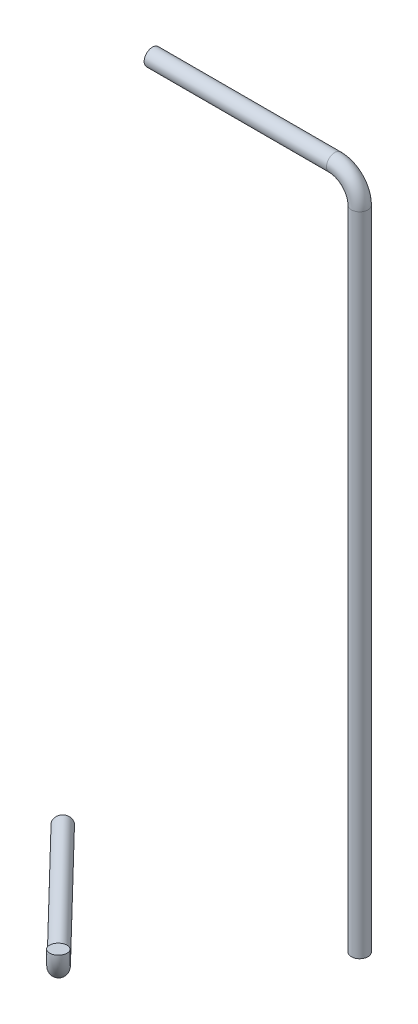
ISO-10303-21;
HEADER;
FILE_DESCRIPTION(('STEP AP214'),'2;1');
FILE_NAME('part.step','',(''),(''),'','','');
FILE_SCHEMA(('AUTOMOTIVE_DESIGN { 1 0 10303 214 1 1 1 1 }'));
ENDSEC;
DATA;
#1=APPLICATION_CONTEXT('core data for automotive mechanical design processes');
#2=APPLICATION_PROTOCOL_DEFINITION('international standard','automotive_design',2000,#1);
#3=PRODUCT_CONTEXT('',#1,'mechanical');
#4=PRODUCT('Part','Part','',(#3));
#5=PRODUCT_RELATED_PRODUCT_CATEGORY('part','',(#4));
#6=PRODUCT_DEFINITION_FORMATION('','',#4);
#7=PRODUCT_DEFINITION_CONTEXT('part definition',#1,'design');
#8=PRODUCT_DEFINITION('design','',#6,#7);
#9=PRODUCT_DEFINITION_SHAPE('','',#8);
#10=(LENGTH_UNIT() NAMED_UNIT(*) SI_UNIT(.MILLI.,.METRE.));
#11=(NAMED_UNIT(*) PLANE_ANGLE_UNIT() SI_UNIT($,.RADIAN.));
#12=(NAMED_UNIT(*) SI_UNIT($,.STERADIAN.) SOLID_ANGLE_UNIT());
#13=UNCERTAINTY_MEASURE_WITH_UNIT(LENGTH_MEASURE(1.E-05),#10,'distance_accuracy_value','');
#14=(GEOMETRIC_REPRESENTATION_CONTEXT(3) GLOBAL_UNCERTAINTY_ASSIGNED_CONTEXT((#13)) GLOBAL_UNIT_ASSIGNED_CONTEXT((#10,
#11,#12)) REPRESENTATION_CONTEXT('',''));
#15=CARTESIAN_POINT('',(0.,0.,0.));
#16=DIRECTION('',(0.,0.,1.));
#17=DIRECTION('',(1.,0.,0.));
#18=AXIS2_PLACEMENT_3D('',#15,#16,#17);
#19=CARTESIAN_POINT('',(6.52406470115073,-81.02,17.8749976775233));
#20=DIRECTION('',(0.0538758205910583,-0.99699365426064,0.0556870659997035));
#21=DIRECTION('',(-0.718698158518047,0.,0.695322196497974));
#22=AXIS2_PLACEMENT_3D('',#19,#20,#21);
#23=PLANE('',#22);
#24=CARTESIAN_POINT('',(6.52406470115073,-81.02,17.8749976775233));
#25=DIRECTION('',(0.0538758205910583,-0.99699365426064,0.0556870659997035));
#26=DIRECTION('',(-0.718698158518047,0.,0.695322196497974));
#27=AXIS2_PLACEMENT_3D('',#24,#25,#26);
#28=CIRCLE('',#27,1.);
#29=CARTESIAN_POINT('',(7.21729651872578,-80.9425167543012,18.5915351808946));
#30=VERTEX_POINT('',#29);
#31=EDGE_CURVE('E49',#30,#30,#28,.T.);
#32=ORIENTED_EDGE('',*,*,#31,.F.);
#33=EDGE_LOOP('',(#32));
#34=FACE_BOUND('',#33,.T.);
#35=ADVANCED_FACE('F39',(#34),#23,.F.);
#36=CARTESIAN_POINT('',(-9.46207468153392,-84.2524497370963,1.35142199704843));
#37=DIRECTION('',(-0.695322196497975,0.,-0.718698158518047));
#38=DIRECTION('',(-0.718698158518047,0.,0.695322196497975));
#39=AXIS2_PLACEMENT_3D('',#36,#37,#38);
#40=PLANE('',#39);
#41=CARTESIAN_POINT('',(-9.46207468153392,-84.2524497370963,1.35142199704843));
#42=DIRECTION('',(-0.695322196497975,0.,-0.718698158518047));
#43=DIRECTION('',(-0.718698158518047,0.,0.695322196497975));
#44=AXIS2_PLACEMENT_3D('',#41,#42,#43);
#45=CIRCLE('',#44,1.);
#46=CARTESIAN_POINT('',(-10.180772840052,-84.2524497370963,2.0467441935464));
#47=VERTEX_POINT('',#46);
#48=EDGE_CURVE('E11',#47,#47,#45,.T.);
#49=ORIENTED_EDGE('',*,*,#48,.T.);
#50=EDGE_LOOP('',(#49));
#51=FACE_BOUND('',#50,.T.);
#52=ADVANCED_FACE('F59',(#51),#40,.T.);
#53=CARTESIAN_POINT('',(4.44436924842558,-81.2524497370963,15.7253851674094));
#54=DIRECTION('',(0.718698158518047,0.,-0.695322196497975));
#55=DIRECTION('',(-0.695322196497975,0.,-0.718698158518047));
#56=AXIS2_PLACEMENT_3D('',#53,#54,#55);
#57=TOROIDAL_SURFACE('',#56,3.00000000000001,1.);
#58=CARTESIAN_POINT('',(4.44436924842547,-84.2524497370963,15.7253851674093));
#59=DIRECTION('',(-0.695322196497975,0.,-0.718698158518047));
#60=DIRECTION('',(-0.718698158518047,0.,0.695322196497975));
#61=AXIS2_PLACEMENT_3D('',#58,#59,#60);
#62=CIRCLE('',#61,1.);
#63=CARTESIAN_POINT('',(4.44436924842544,-85.2524497370963,15.7253851674092));
#64=VERTEX_POINT('',#63);
#65=EDGE_CURVE('E45',#64,#64,#62,.T.);
#66=CARTESIAN_POINT('',(4.44436924842558,-81.2524497370963,15.7253851674094));
#67=DIRECTION('',(0.718698158518047,0.,-0.695322196497975));
#68=DIRECTION('',(-0.695322196497975,0.,-0.718698158518047));
#69=AXIS2_PLACEMENT_3D('',#66,#67,#68);
#70=CIRCLE('',#69,4.00000000000001);
#71=EDGE_CURVE('',#30,#64,#70,.T.);
#72=ORIENTED_EDGE('',*,*,#31,.T.);
#73=ORIENTED_EDGE('',*,*,#65,.F.);
#74=ORIENTED_EDGE('',*,*,#71,.T.);
#75=ORIENTED_EDGE('',*,*,#71,.F.);
#76=EDGE_LOOP('',(#72,#74,#73,#75));
#77=FACE_BOUND('',#76,.T.);
#78=ADVANCED_FACE('F56',(#77),#57,.T.);
#79=CARTESIAN_POINT('',(4.44436924842558,-84.2524497370963,15.7253851674094));
#80=DIRECTION('',(-0.695322196497975,0.,-0.718698158518047));
#81=DIRECTION('',(-0.718698158518047,0.,0.695322196497975));
#82=AXIS2_PLACEMENT_3D('',#79,#80,#81);
#83=CYLINDRICAL_SURFACE('',#82,1.);
#84=ORIENTED_EDGE('',*,*,#48,.F.);
#85=EDGE_LOOP('',(#84));
#86=FACE_BOUND('',#85,.T.);
#87=ORIENTED_EDGE('',*,*,#65,.T.);
#88=EDGE_LOOP('',(#87));
#89=FACE_BOUND('',#88,.T.);
#90=ADVANCED_FACE('F63',(#86,#89),#83,.T.);
#91=CLOSED_SHELL('',(#35,#52,#78,#90));
#92=MANIFOLD_SOLID_BREP('B2',#91);
#93=CARTESIAN_POINT('',(0.,0.,0.));
#94=DIRECTION('',(1.,0.,0.));
#95=DIRECTION('',(0.,0.,-1.));
#96=AXIS2_PLACEMENT_3D('',#93,#94,#95);
#97=PLANE('',#96);
#98=CARTESIAN_POINT('',(0.,0.,0.));
#99=DIRECTION('',(1.,0.,0.));
#100=DIRECTION('',(0.,0.,-1.));
#101=AXIS2_PLACEMENT_3D('',#98,#99,#100);
#102=CIRCLE('',#101,1.);
#103=CARTESIAN_POINT('',(0.,0.,-1.));
#104=VERTEX_POINT('',#103);
#105=EDGE_CURVE('E109',#104,#104,#102,.T.);
#106=ORIENTED_EDGE('',*,*,#105,.F.);
#107=EDGE_LOOP('',(#106));
#108=FACE_BOUND('',#107,.T.);
#109=ADVANCED_FACE('F95',(#108),#97,.F.);
#110=CARTESIAN_POINT('',(25.,-81.02,0.));
#111=DIRECTION('',(0.,-1.,0.));
#112=DIRECTION('',(0.,0.,-1.));
#113=AXIS2_PLACEMENT_3D('',#110,#111,#112);
#114=PLANE('',#113);
#115=CARTESIAN_POINT('',(25.,-81.02,0.));
#116=DIRECTION('',(0.,-1.,0.));
#117=DIRECTION('',(0.,0.,-1.));
#118=AXIS2_PLACEMENT_3D('',#115,#116,#117);
#119=CIRCLE('',#118,1.);
#120=CARTESIAN_POINT('',(25.,-81.02,-1.));
#121=VERTEX_POINT('',#120);
#122=EDGE_CURVE('E38',#121,#121,#119,.T.);
#123=ORIENTED_EDGE('',*,*,#122,.T.);
#124=EDGE_LOOP('',(#123));
#125=FACE_BOUND('',#124,.T.);
#126=ADVANCED_FACE('F118',(#125),#114,.T.);
#127=CARTESIAN_POINT('',(0.,0.,0.));
#128=DIRECTION('',(1.,0.,0.));
#129=DIRECTION('',(0.,0.,-1.));
#130=AXIS2_PLACEMENT_3D('',#127,#128,#129);
#131=CYLINDRICAL_SURFACE('',#130,1.);
#132=CARTESIAN_POINT('',(22.,0.,0.));
#133=DIRECTION('',(1.,0.,0.));
#134=DIRECTION('',(0.,0.,-1.));
#135=AXIS2_PLACEMENT_3D('',#132,#133,#134);
#136=CIRCLE('',#135,1.);
#137=CARTESIAN_POINT('',(22.,1.,0.));
#138=VERTEX_POINT('',#137);
#139=EDGE_CURVE('E105',#138,#138,#136,.T.);
#140=ORIENTED_EDGE('',*,*,#139,.F.);
#141=EDGE_LOOP('',(#140));
#142=FACE_BOUND('',#141,.T.);
#143=ORIENTED_EDGE('',*,*,#105,.T.);
#144=EDGE_LOOP('',(#143));
#145=FACE_BOUND('',#144,.T.);
#146=ADVANCED_FACE('F115',(#142,#145),#131,.T.);
#147=CARTESIAN_POINT('',(22.,-3.,0.));
#148=DIRECTION('',(0.,0.,-1.));
#149=DIRECTION('',(-1.,0.,0.));
#150=AXIS2_PLACEMENT_3D('',#147,#148,#149);
#151=TOROIDAL_SURFACE('',#150,3.,1.);
#152=CARTESIAN_POINT('',(25.,-3.,0.));
#153=DIRECTION('',(0.,-1.,0.));
#154=DIRECTION('',(0.,0.,-1.));
#155=AXIS2_PLACEMENT_3D('',#152,#153,#154);
#156=CIRCLE('',#155,1.);
#157=CARTESIAN_POINT('',(26.,-3.,0.));
#158=VERTEX_POINT('',#157);
#159=EDGE_CURVE('E101',#158,#158,#156,.T.);
#160=CARTESIAN_POINT('',(22.,-3.,0.));
#161=DIRECTION('',(0.,0.,-1.));
#162=DIRECTION('',(-1.,0.,0.));
#163=AXIS2_PLACEMENT_3D('',#160,#161,#162);
#164=CIRCLE('',#163,4.);
#165=EDGE_CURVE('',#138,#158,#164,.T.);
#166=ORIENTED_EDGE('',*,*,#139,.T.);
#167=ORIENTED_EDGE('',*,*,#159,.F.);
#168=ORIENTED_EDGE('',*,*,#165,.T.);
#169=ORIENTED_EDGE('',*,*,#165,.F.);
#170=EDGE_LOOP('',(#166,#168,#167,#169));
#171=FACE_BOUND('',#170,.T.);
#172=ADVANCED_FACE('F124',(#171),#151,.T.);
#173=CARTESIAN_POINT('',(25.,-3.,0.));
#174=DIRECTION('',(0.,-1.,0.));
#175=DIRECTION('',(1.,0.,0.));
#176=AXIS2_PLACEMENT_3D('',#173,#174,#175);
#177=CYLINDRICAL_SURFACE('',#176,1.);
#178=ORIENTED_EDGE('',*,*,#122,.F.);
#179=EDGE_LOOP('',(#178));
#180=FACE_BOUND('',#179,.T.);
#181=ORIENTED_EDGE('',*,*,#159,.T.);
#182=EDGE_LOOP('',(#181));
#183=FACE_BOUND('',#182,.T.);
#184=ADVANCED_FACE('F122',(#180,#183),#177,.T.);
#185=CLOSED_SHELL('',(#109,#126,#146,#172,#184));
#186=MANIFOLD_SOLID_BREP('B6',#185);
#187=ADVANCED_BREP_SHAPE_REPRESENTATION('',(#18,#92,#186),#14);
#188=SHAPE_DEFINITION_REPRESENTATION(#9,#187);
ENDSEC;
END-ISO-10303-21;
